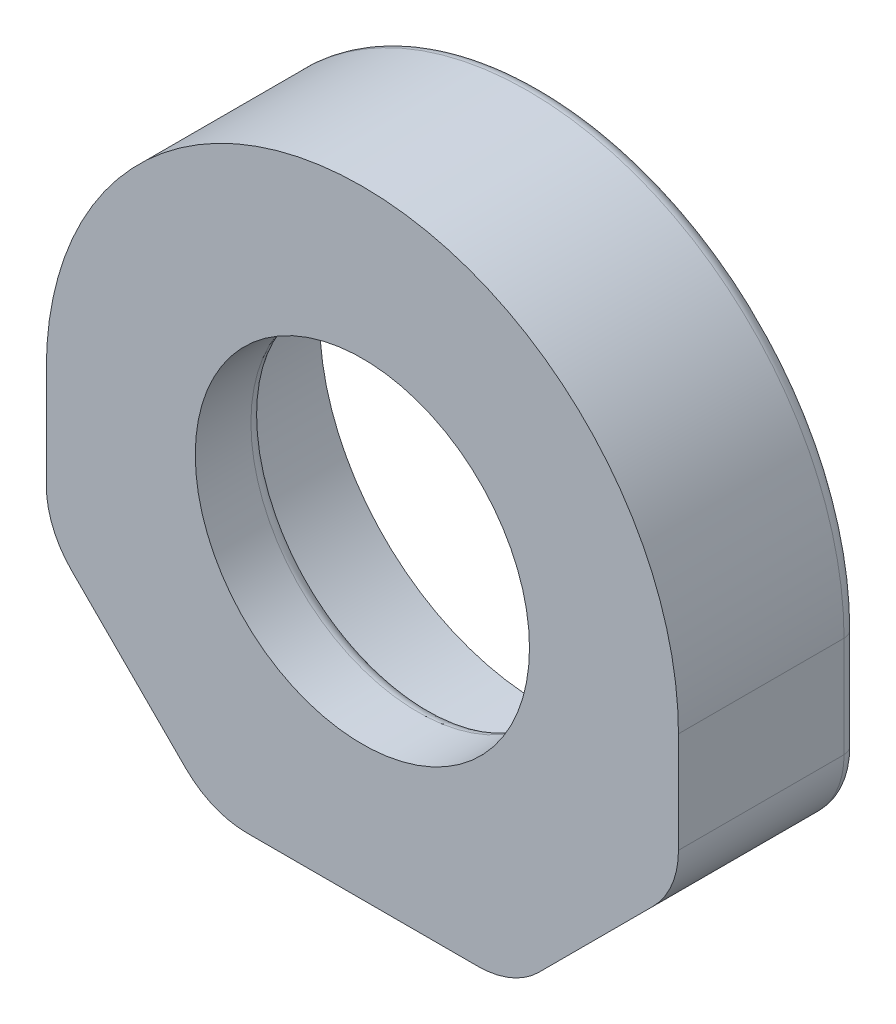
ISO-10303-21;
HEADER;
FILE_DESCRIPTION(('STEP AP214'),'2;1');
FILE_NAME('part.step','',(''),(''),'','','');
FILE_SCHEMA(('AUTOMOTIVE_DESIGN { 1 0 10303 214 1 1 1 1 }'));
ENDSEC;
DATA;
#1=APPLICATION_CONTEXT('core data for automotive mechanical design processes');
#2=APPLICATION_PROTOCOL_DEFINITION('international standard','automotive_design',2000,#1);
#3=PRODUCT_CONTEXT('',#1,'mechanical');
#4=PRODUCT('Part','Part','',(#3));
#5=PRODUCT_RELATED_PRODUCT_CATEGORY('part','',(#4));
#6=PRODUCT_DEFINITION_FORMATION('','',#4);
#7=PRODUCT_DEFINITION_CONTEXT('part definition',#1,'design');
#8=PRODUCT_DEFINITION('design','',#6,#7);
#9=PRODUCT_DEFINITION_SHAPE('','',#8);
#10=(LENGTH_UNIT() NAMED_UNIT(*) SI_UNIT(.MILLI.,.METRE.));
#11=(NAMED_UNIT(*) PLANE_ANGLE_UNIT() SI_UNIT($,.RADIAN.));
#12=(NAMED_UNIT(*) SI_UNIT($,.STERADIAN.) SOLID_ANGLE_UNIT());
#13=UNCERTAINTY_MEASURE_WITH_UNIT(LENGTH_MEASURE(1.E-05),#10,'distance_accuracy_value','');
#14=(GEOMETRIC_REPRESENTATION_CONTEXT(3) GLOBAL_UNCERTAINTY_ASSIGNED_CONTEXT((#13)) GLOBAL_UNIT_ASSIGNED_CONTEXT((#10,
#11,#12)) REPRESENTATION_CONTEXT('',''));
#15=CARTESIAN_POINT('',(0.,0.,0.));
#16=DIRECTION('',(0.,0.,1.));
#17=DIRECTION('',(1.,0.,0.));
#18=AXIS2_PLACEMENT_3D('',#15,#16,#17);
#19=CARTESIAN_POINT('',(0.,0.,63.5));
#20=DIRECTION('',(0.,0.,-1.));
#21=DIRECTION('',(-1.,0.,0.));
#22=AXIS2_PLACEMENT_3D('',#19,#20,#21);
#23=CYLINDRICAL_SURFACE('',#22,19.304);
#24=CARTESIAN_POINT('',(0.,0.,-42.7834107348118));
#25=DIRECTION('',(0.,0.,-1.));
#26=DIRECTION('',(-1.,0.,0.));
#27=AXIS2_PLACEMENT_3D('',#24,#25,#26);
#28=CIRCLE('',#27,19.304);
#29=CARTESIAN_POINT('',(-19.304,0.,-42.7834107348118));
#30=VERTEX_POINT('',#29);
#31=EDGE_CURVE('E281',#30,#30,#28,.F.);
#32=ORIENTED_EDGE('',*,*,#31,.T.);
#33=EDGE_LOOP('',(#32));
#34=FACE_BOUND('',#33,.T.);
#35=CARTESIAN_POINT('',(0.,0.,-49.2125));
#36=DIRECTION('',(0.,0.,-1.));
#37=DIRECTION('',(-1.,0.,0.));
#38=AXIS2_PLACEMENT_3D('',#35,#36,#37);
#39=CIRCLE('',#38,19.304);
#40=CARTESIAN_POINT('',(-19.304,0.,-49.2125));
#41=VERTEX_POINT('',#40);
#42=EDGE_CURVE('E271',#41,#41,#39,.T.);
#43=ORIENTED_EDGE('',*,*,#42,.T.);
#44=EDGE_LOOP('',(#43));
#45=FACE_BOUND('',#44,.T.);
#46=ADVANCED_FACE('F42',(#34,#45),#23,.F.);
#47=CARTESIAN_POINT('',(0.,0.,-63.5));
#48=DIRECTION('',(0.,0.,1.));
#49=DIRECTION('',(1.,0.,0.));
#50=AXIS2_PLACEMENT_3D('',#47,#48,#49);
#51=CYLINDRICAL_SURFACE('',#50,36.5125);
#52=CARTESIAN_POINT('',(0.,0.,-42.7834107348118));
#53=DIRECTION('',(0.,0.,-1.));
#54=DIRECTION('',(-1.,0.,0.));
#55=AXIS2_PLACEMENT_3D('',#52,#53,#54);
#56=CIRCLE('',#55,36.5125);
#57=CARTESIAN_POINT('',(36.5125,0.,-42.7834107348118));
#58=VERTEX_POINT('',#57);
#59=CARTESIAN_POINT('',(-36.5125,0.,-42.7834107348118));
#60=VERTEX_POINT('',#59);
#61=EDGE_CURVE('E161',#58,#60,#56,.F.);
#62=ORIENTED_EDGE('',*,*,#61,.F.);
#63=DIRECTION('',(0.,0.,1.));
#64=VECTOR('',#63,1.);
#65=CARTESIAN_POINT('',(36.5125,0.,-63.5));
#66=LINE('',#65,#64);
#67=CARTESIAN_POINT('',(36.5125,0.,-61.9125));
#68=VERTEX_POINT('',#67);
#69=EDGE_CURVE('E169',#68,#58,#66,.T.);
#70=ORIENTED_EDGE('',*,*,#69,.F.);
#71=CARTESIAN_POINT('',(0.,0.,-61.9125));
#72=DIRECTION('',(0.,0.,1.));
#73=DIRECTION('',(1.,0.,0.));
#74=AXIS2_PLACEMENT_3D('',#71,#72,#73);
#75=CIRCLE('',#74,36.5125);
#76=CARTESIAN_POINT('',(-36.5125,0.,-61.9125));
#77=VERTEX_POINT('',#76);
#78=EDGE_CURVE('E51',#68,#77,#75,.T.);
#79=ORIENTED_EDGE('',*,*,#78,.T.);
#80=DIRECTION('',(0.,0.,1.));
#81=VECTOR('',#80,1.);
#82=CARTESIAN_POINT('',(-36.5125,0.,-63.5));
#83=LINE('',#82,#81);
#84=EDGE_CURVE('E178',#77,#60,#83,.T.);
#85=ORIENTED_EDGE('',*,*,#84,.T.);
#86=EDGE_LOOP('',(#62,#70,#79,#85));
#87=FACE_BOUND('',#86,.T.);
#88=ADVANCED_FACE('F354',(#87),#51,.T.);
#89=CARTESIAN_POINT('',(36.5125,0.,-63.5));
#90=DIRECTION('',(-1.,0.,0.));
#91=DIRECTION('',(0.,0.,1.));
#92=AXIS2_PLACEMENT_3D('',#89,#90,#91);
#93=PLANE('',#92);
#94=ORIENTED_EDGE('',*,*,#69,.T.);
#95=DIRECTION('',(0.,1.,0.));
#96=VECTOR('',#95,1.);
#97=CARTESIAN_POINT('',(36.5125,-34.8451023838905,-42.7834107348118));
#98=LINE('',#97,#96);
#99=CARTESIAN_POINT('',(36.5125,-11.6529667601595,-42.7834107348118));
#100=VERTEX_POINT('',#99);
#101=EDGE_CURVE('E152',#100,#58,#98,.T.);
#102=ORIENTED_EDGE('',*,*,#101,.F.);
#103=DIRECTION('',(0.,0.,-1.));
#104=VECTOR('',#103,1.);
#105=CARTESIAN_POINT('',(36.5125,-11.6529667601595,-63.5));
#106=LINE('',#105,#104);
#107=CARTESIAN_POINT('',(36.5125,-11.6529667601595,-61.9125));
#108=VERTEX_POINT('',#107);
#109=EDGE_CURVE('E167',#100,#108,#106,.T.);
#110=ORIENTED_EDGE('',*,*,#109,.T.);
#111=DIRECTION('',(0.,-1.,0.));
#112=VECTOR('',#111,1.);
#113=CARTESIAN_POINT('',(36.5125,0.,-61.9125));
#114=LINE('',#113,#112);
#115=EDGE_CURVE('E238',#108,#68,#114,.F.);
#116=ORIENTED_EDGE('',*,*,#115,.T.);
#117=EDGE_LOOP('',(#94,#102,#110,#116));
#118=FACE_BOUND('',#117,.T.);
#119=ADVANCED_FACE('F165',(#118),#93,.F.);
#120=CARTESIAN_POINT('',(-36.5125,-34.8451023838905,-63.5));
#121=DIRECTION('',(0.,-1.,0.));
#122=DIRECTION('',(0.,0.,-1.));
#123=AXIS2_PLACEMENT_3D('',#120,#121,#122);
#124=PLANE('',#123);
#125=DIRECTION('',(1.,0.,0.));
#126=VECTOR('',#125,1.);
#127=CARTESIAN_POINT('',(-36.5125,-34.8451023838905,-42.7834107348118));
#128=LINE('',#127,#126);
#129=CARTESIAN_POINT('',(-13.320364376269,-34.8451023838905,-42.7834107348118));
#130=VERTEX_POINT('',#129);
#131=CARTESIAN_POINT('',(13.320364376269,-34.8451023838905,-42.7834107348118));
#132=VERTEX_POINT('',#131);
#133=EDGE_CURVE('E346',#130,#132,#128,.T.);
#134=ORIENTED_EDGE('',*,*,#133,.F.);
#135=DIRECTION('',(0.,0.,1.));
#136=VECTOR('',#135,1.);
#137=CARTESIAN_POINT('',(-13.320364376269,-34.8451023838905,-63.5));
#138=LINE('',#137,#136);
#139=CARTESIAN_POINT('',(-13.320364376269,-34.8451023838905,-61.9125));
#140=VERTEX_POINT('',#139);
#141=EDGE_CURVE('E189',#130,#140,#138,.F.);
#142=ORIENTED_EDGE('',*,*,#141,.T.);
#143=DIRECTION('',(1.,0.,0.));
#144=VECTOR('',#143,1.);
#145=CARTESIAN_POINT('',(13.320364376269,-34.8451023838905,-61.9125));
#146=LINE('',#145,#144);
#147=CARTESIAN_POINT('',(13.320364376269,-34.8451023838905,-61.9125));
#148=VERTEX_POINT('',#147);
#149=EDGE_CURVE('E250',#140,#148,#146,.T.);
#150=ORIENTED_EDGE('',*,*,#149,.T.);
#151=DIRECTION('',(0.,0.,1.));
#152=VECTOR('',#151,1.);
#153=CARTESIAN_POINT('',(13.320364376269,-34.8451023838905,-63.5));
#154=LINE('',#153,#152);
#155=EDGE_CURVE('E192',#148,#132,#154,.T.);
#156=ORIENTED_EDGE('',*,*,#155,.T.);
#157=EDGE_LOOP('',(#134,#142,#150,#156));
#158=FACE_BOUND('',#157,.T.);
#159=ADVANCED_FACE('F361',(#158),#124,.T.);
#160=CARTESIAN_POINT('',(-36.5125,0.,-63.5));
#161=DIRECTION('',(-1.,0.,0.));
#162=DIRECTION('',(0.,0.,1.));
#163=AXIS2_PLACEMENT_3D('',#160,#161,#162);
#164=PLANE('',#163);
#165=DIRECTION('',(0.,1.,0.));
#166=VECTOR('',#165,1.);
#167=CARTESIAN_POINT('',(-36.5125,-34.8451023838905,-42.7834107348118));
#168=LINE('',#167,#166);
#169=CARTESIAN_POINT('',(-36.5125,-11.6529667601595,-42.7834107348118));
#170=VERTEX_POINT('',#169);
#171=EDGE_CURVE('E57',#170,#60,#168,.T.);
#172=ORIENTED_EDGE('',*,*,#171,.T.);
#173=ORIENTED_EDGE('',*,*,#84,.F.);
#174=DIRECTION('',(0.,-1.,0.));
#175=VECTOR('',#174,1.);
#176=CARTESIAN_POINT('',(-36.5125,-11.6529667601595,-61.9125));
#177=LINE('',#176,#175);
#178=CARTESIAN_POINT('',(-36.5125,-11.6529667601595,-61.9125));
#179=VERTEX_POINT('',#178);
#180=EDGE_CURVE('E264',#77,#179,#177,.T.);
#181=ORIENTED_EDGE('',*,*,#180,.T.);
#182=DIRECTION('',(0.,0.,-1.));
#183=VECTOR('',#182,1.);
#184=CARTESIAN_POINT('',(-36.5125,-11.6529667601595,-63.5));
#185=LINE('',#184,#183);
#186=EDGE_CURVE('E203',#179,#170,#185,.F.);
#187=ORIENTED_EDGE('',*,*,#186,.T.);
#188=EDGE_LOOP('',(#172,#173,#181,#187));
#189=FACE_BOUND('',#188,.T.);
#190=ADVANCED_FACE('F351',(#189),#164,.T.);
#191=CARTESIAN_POINT('',(0.,0.,-63.5));
#192=DIRECTION('',(0.,0.,1.));
#193=DIRECTION('',(1.,0.,0.));
#194=AXIS2_PLACEMENT_3D('',#191,#192,#193);
#195=PLANE('',#194);
#196=CARTESIAN_POINT('',(0.,0.,-63.5));
#197=DIRECTION('',(0.,0.,1.));
#198=DIRECTION('',(1.,0.,0.));
#199=AXIS2_PLACEMENT_3D('',#196,#197,#198);
#200=CIRCLE('',#199,34.925);
#201=CARTESIAN_POINT('',(-34.925,0.,-63.5));
#202=VERTEX_POINT('',#201);
#203=CARTESIAN_POINT('',(34.925,0.,-63.5));
#204=VERTEX_POINT('',#203);
#205=EDGE_CURVE('E207',#202,#204,#200,.F.);
#206=ORIENTED_EDGE('',*,*,#205,.T.);
#207=DIRECTION('',(0.,-1.,0.));
#208=VECTOR('',#207,1.);
#209=CARTESIAN_POINT('',(34.925,0.,-63.5));
#210=LINE('',#209,#208);
#211=CARTESIAN_POINT('',(34.925,-11.6529667601595,-63.5));
#212=VERTEX_POINT('',#211);
#213=EDGE_CURVE('E234',#204,#212,#210,.T.);
#214=ORIENTED_EDGE('',*,*,#213,.T.);
#215=CARTESIAN_POINT('',(26.5125,-11.6529667601595,-63.5));
#216=DIRECTION('',(0.,0.,1.));
#217=DIRECTION('',(1.,0.,0.));
#218=AXIS2_PLACEMENT_3D('',#215,#216,#217);
#219=CIRCLE('',#218,8.4125);
#220=CARTESIAN_POINT('',(32.4610357967318,-17.6015025568913,-63.5));
#221=VERTEX_POINT('',#220);
#222=EDGE_CURVE('E231',#212,#221,#219,.F.);
#223=ORIENTED_EDGE('',*,*,#222,.T.);
#224=DIRECTION('',(-0.707106781186546,-0.707106781186549,0.));
#225=VECTOR('',#224,1.);
#226=CARTESIAN_POINT('',(19.2689001730009,-30.7936381806223,-63.5));
#227=LINE('',#226,#225);
#228=CARTESIAN_POINT('',(19.2689001730009,-30.7936381806223,-63.5));
#229=VERTEX_POINT('',#228);
#230=EDGE_CURVE('E228',#221,#229,#227,.T.);
#231=ORIENTED_EDGE('',*,*,#230,.T.);
#232=CARTESIAN_POINT('',(13.320364376269,-24.8451023838905,-63.5));
#233=DIRECTION('',(0.,0.,1.));
#234=DIRECTION('',(1.,0.,0.));
#235=AXIS2_PLACEMENT_3D('',#232,#233,#234);
#236=CIRCLE('',#235,8.4125);
#237=CARTESIAN_POINT('',(13.320364376269,-33.2576023838905,-63.5));
#238=VERTEX_POINT('',#237);
#239=EDGE_CURVE('E225',#229,#238,#236,.F.);
#240=ORIENTED_EDGE('',*,*,#239,.T.);
#241=DIRECTION('',(1.,0.,0.));
#242=VECTOR('',#241,1.);
#243=CARTESIAN_POINT('',(-13.320364376269,-33.2576023838905,-63.5));
#244=LINE('',#243,#242);
#245=CARTESIAN_POINT('',(-13.320364376269,-33.2576023838905,-63.5));
#246=VERTEX_POINT('',#245);
#247=EDGE_CURVE('E222',#238,#246,#244,.F.);
#248=ORIENTED_EDGE('',*,*,#247,.T.);
#249=CARTESIAN_POINT('',(-13.320364376269,-24.8451023838905,-63.5));
#250=DIRECTION('',(0.,0.,1.));
#251=DIRECTION('',(1.,0.,0.));
#252=AXIS2_PLACEMENT_3D('',#249,#250,#251);
#253=CIRCLE('',#252,8.4125);
#254=CARTESIAN_POINT('',(-19.2689001730008,-30.7936381806223,-63.5));
#255=VERTEX_POINT('',#254);
#256=EDGE_CURVE('E219',#246,#255,#253,.F.);
#257=ORIENTED_EDGE('',*,*,#256,.T.);
#258=DIRECTION('',(0.707106781186549,-0.707106781186546,0.));
#259=VECTOR('',#258,1.);
#260=CARTESIAN_POINT('',(-32.4610357967318,-17.6015025568914,-63.5));
#261=LINE('',#260,#259);
#262=CARTESIAN_POINT('',(-32.4610357967318,-17.6015025568914,-63.5));
#263=VERTEX_POINT('',#262);
#264=EDGE_CURVE('E216',#255,#263,#261,.F.);
#265=ORIENTED_EDGE('',*,*,#264,.T.);
#266=CARTESIAN_POINT('',(-26.5125,-11.6529667601595,-63.5));
#267=DIRECTION('',(0.,0.,1.));
#268=DIRECTION('',(1.,0.,0.));
#269=AXIS2_PLACEMENT_3D('',#266,#267,#268);
#270=CIRCLE('',#269,8.4125);
#271=CARTESIAN_POINT('',(-34.925,-11.6529667601595,-63.5));
#272=VERTEX_POINT('',#271);
#273=EDGE_CURVE('E213',#263,#272,#270,.F.);
#274=ORIENTED_EDGE('',*,*,#273,.T.);
#275=DIRECTION('',(0.,-1.,0.));
#276=VECTOR('',#275,1.);
#277=CARTESIAN_POINT('',(-34.925,0.,-63.5));
#278=LINE('',#277,#276);
#279=EDGE_CURVE('E210',#272,#202,#278,.F.);
#280=ORIENTED_EDGE('',*,*,#279,.T.);
#281=EDGE_LOOP('',(#206,#214,#223,#231,#240,#248,#257,#265,#274,#280));
#282=FACE_BOUND('',#281,.T.);
#283=CARTESIAN_POINT('',(0.,0.,-63.5));
#284=DIRECTION('',(0.,0.,-1.));
#285=DIRECTION('',(-1.,0.,0.));
#286=AXIS2_PLACEMENT_3D('',#283,#284,#285);
#287=CIRCLE('',#286,25.654);
#288=CARTESIAN_POINT('',(-25.654,0.,-63.5));
#289=VERTEX_POINT('',#288);
#290=EDGE_CURVE('E314',#289,#289,#287,.T.);
#291=ORIENTED_EDGE('',*,*,#290,.F.);
#292=EDGE_LOOP('',(#291));
#293=FACE_BOUND('',#292,.T.);
#294=ADVANCED_FACE('F367',(#282,#293),#195,.F.);
#295=CARTESIAN_POINT('',(0.,0.,-50.8));
#296=DIRECTION('',(0.,0.,-1.));
#297=DIRECTION('',(-1.,0.,0.));
#298=AXIS2_PLACEMENT_3D('',#295,#296,#297);
#299=PLANE('',#298);
#300=CARTESIAN_POINT('',(0.,0.,-50.8));
#301=DIRECTION('',(0.,0.,-1.));
#302=DIRECTION('',(-1.,0.,0.));
#303=AXIS2_PLACEMENT_3D('',#300,#301,#302);
#304=CIRCLE('',#303,20.8915);
#305=CARTESIAN_POINT('',(-20.8915,0.,-50.8));
#306=VERTEX_POINT('',#305);
#307=EDGE_CURVE('E267',#306,#306,#304,.F.);
#308=ORIENTED_EDGE('',*,*,#307,.T.);
#309=EDGE_LOOP('',(#308));
#310=FACE_BOUND('',#309,.T.);
#311=CARTESIAN_POINT('',(0.,0.,-50.8));
#312=DIRECTION('',(0.,0.,-1.));
#313=DIRECTION('',(-1.,0.,0.));
#314=AXIS2_PLACEMENT_3D('',#311,#312,#313);
#315=CIRCLE('',#314,25.654);
#316=CARTESIAN_POINT('',(-25.654,0.,-50.8));
#317=VERTEX_POINT('',#316);
#318=EDGE_CURVE('E321',#317,#317,#315,.T.);
#319=ORIENTED_EDGE('',*,*,#318,.T.);
#320=EDGE_LOOP('',(#319));
#321=FACE_BOUND('',#320,.T.);
#322=ADVANCED_FACE('F470',(#310,#321),#299,.T.);
#323=CARTESIAN_POINT('',(0.,0.,-50.8));
#324=DIRECTION('',(0.,0.,-1.));
#325=DIRECTION('',(-1.,0.,0.));
#326=AXIS2_PLACEMENT_3D('',#323,#324,#325);
#327=CYLINDRICAL_SURFACE('',#326,25.654);
#328=ORIENTED_EDGE('',*,*,#318,.F.);
#329=EDGE_LOOP('',(#328));
#330=FACE_BOUND('',#329,.T.);
#331=ORIENTED_EDGE('',*,*,#290,.T.);
#332=EDGE_LOOP('',(#331));
#333=FACE_BOUND('',#332,.T.);
#334=ADVANCED_FACE('F377',(#330,#333),#327,.F.);
#335=CARTESIAN_POINT('',(17.4625,-34.8451023838905,-63.5));
#336=DIRECTION('',(0.707106781186549,-0.707106781186546,0.));
#337=DIRECTION('',(0.,0.,-1.));
#338=AXIS2_PLACEMENT_3D('',#335,#336,#337);
#339=PLANE('',#338);
#340=DIRECTION('',(0.707106781186546,0.707106781186549,0.));
#341=VECTOR('',#340,1.);
#342=CARTESIAN_POINT('',(17.4625,-34.8451023838905,-42.7834107348118));
#343=LINE('',#342,#341);
#344=CARTESIAN_POINT('',(20.3914321881345,-31.9161701957559,-42.7834107348118));
#345=VERTEX_POINT('',#344);
#346=CARTESIAN_POINT('',(33.5835678118655,-18.7240345720249,-42.7834107348118));
#347=VERTEX_POINT('',#346);
#348=EDGE_CURVE('E155',#345,#347,#343,.T.);
#349=ORIENTED_EDGE('',*,*,#348,.F.);
#350=DIRECTION('',(0.,0.,1.));
#351=VECTOR('',#350,1.);
#352=CARTESIAN_POINT('',(20.3914321881345,-31.9161701957559,-63.5));
#353=LINE('',#352,#351);
#354=CARTESIAN_POINT('',(20.3914321881345,-31.9161701957559,-61.9125));
#355=VERTEX_POINT('',#354);
#356=EDGE_CURVE('E177',#345,#355,#353,.F.);
#357=ORIENTED_EDGE('',*,*,#356,.T.);
#358=DIRECTION('',(-0.707106781186546,-0.707106781186549,0.));
#359=VECTOR('',#358,1.);
#360=CARTESIAN_POINT('',(33.5835678118655,-18.7240345720249,-61.9125));
#361=LINE('',#360,#359);
#362=CARTESIAN_POINT('',(33.5835678118655,-18.7240345720249,-61.9125));
#363=VERTEX_POINT('',#362);
#364=EDGE_CURVE('E243',#355,#363,#361,.F.);
#365=ORIENTED_EDGE('',*,*,#364,.T.);
#366=DIRECTION('',(0.,0.,-1.));
#367=VECTOR('',#366,1.);
#368=CARTESIAN_POINT('',(33.5835678118655,-18.7240345720249,63.5));
#369=LINE('',#368,#367);
#370=EDGE_CURVE('E182',#363,#347,#369,.F.);
#371=ORIENTED_EDGE('',*,*,#370,.T.);
#372=EDGE_LOOP('',(#349,#357,#365,#371));
#373=FACE_BOUND('',#372,.T.);
#374=ADVANCED_FACE('F373',(#373),#339,.T.);
#375=CARTESIAN_POINT('',(-36.5125,-15.7951023838905,-63.5));
#376=DIRECTION('',(0.707106781186546,0.707106781186549,0.));
#377=DIRECTION('',(0.,0.,1.));
#378=AXIS2_PLACEMENT_3D('',#375,#376,#377);
#379=PLANE('',#378);
#380=DIRECTION('',(-0.707106781186549,0.707106781186546,0.));
#381=VECTOR('',#380,1.);
#382=CARTESIAN_POINT('',(-36.5125,-15.7951023838905,-42.7834107348118));
#383=LINE('',#382,#381);
#384=CARTESIAN_POINT('',(-33.5835678118655,-18.724034572025,-42.7834107348118));
#385=VERTEX_POINT('',#384);
#386=CARTESIAN_POINT('',(-20.3914321881345,-31.916170195756,-42.7834107348118));
#387=VERTEX_POINT('',#386);
#388=EDGE_CURVE('E343',#385,#387,#383,.F.);
#389=ORIENTED_EDGE('',*,*,#388,.F.);
#390=DIRECTION('',(0.,0.,1.));
#391=VECTOR('',#390,1.);
#392=CARTESIAN_POINT('',(-33.5835678118655,-18.724034572025,-63.5));
#393=LINE('',#392,#391);
#394=CARTESIAN_POINT('',(-33.5835678118655,-18.724034572025,-61.9125));
#395=VERTEX_POINT('',#394);
#396=EDGE_CURVE('E196',#385,#395,#393,.F.);
#397=ORIENTED_EDGE('',*,*,#396,.T.);
#398=DIRECTION('',(-0.707106781186549,0.707106781186546,0.));
#399=VECTOR('',#398,1.);
#400=CARTESIAN_POINT('',(-20.3914321881345,-31.916170195756,-61.9125));
#401=LINE('',#400,#399);
#402=CARTESIAN_POINT('',(-20.3914321881345,-31.916170195756,-61.9125));
#403=VERTEX_POINT('',#402);
#404=EDGE_CURVE('E257',#395,#403,#401,.F.);
#405=ORIENTED_EDGE('',*,*,#404,.T.);
#406=DIRECTION('',(0.,0.,-1.));
#407=VECTOR('',#406,1.);
#408=CARTESIAN_POINT('',(-20.3914321881345,-31.916170195756,-63.5));
#409=LINE('',#408,#407);
#410=EDGE_CURVE('E199',#403,#387,#409,.F.);
#411=ORIENTED_EDGE('',*,*,#410,.T.);
#412=EDGE_LOOP('',(#389,#397,#405,#411));
#413=FACE_BOUND('',#412,.T.);
#414=ADVANCED_FACE('F376',(#413),#379,.F.);
#415=CARTESIAN_POINT('',(26.5125,-11.6529667601595,-63.5));
#416=DIRECTION('',(0.,0.,1.));
#417=DIRECTION('',(1.,0.,0.));
#418=AXIS2_PLACEMENT_3D('',#415,#416,#417);
#419=CYLINDRICAL_SURFACE('',#418,10.);
#420=CARTESIAN_POINT('',(26.5125,-11.6529667601595,-42.7834107348118));
#421=DIRECTION('',(0.,0.,-1.));
#422=DIRECTION('',(-1.,0.,0.));
#423=AXIS2_PLACEMENT_3D('',#420,#421,#422);
#424=CIRCLE('',#423,10.);
#425=EDGE_CURVE('E148',#347,#100,#424,.F.);
#426=ORIENTED_EDGE('',*,*,#425,.F.);
#427=ORIENTED_EDGE('',*,*,#370,.F.);
#428=CARTESIAN_POINT('',(26.5125,-11.6529667601595,-61.9125));
#429=DIRECTION('',(0.,0.,1.));
#430=DIRECTION('',(1.,0.,0.));
#431=AXIS2_PLACEMENT_3D('',#428,#429,#430);
#432=CIRCLE('',#431,10.);
#433=EDGE_CURVE('E174',#363,#108,#432,.T.);
#434=ORIENTED_EDGE('',*,*,#433,.T.);
#435=ORIENTED_EDGE('',*,*,#109,.F.);
#436=EDGE_LOOP('',(#426,#427,#434,#435));
#437=FACE_BOUND('',#436,.T.);
#438=ADVANCED_FACE('F172',(#437),#419,.T.);
#439=CARTESIAN_POINT('',(13.320364376269,-24.8451023838905,-63.5));
#440=DIRECTION('',(0.,0.,1.));
#441=DIRECTION('',(1.,0.,0.));
#442=AXIS2_PLACEMENT_3D('',#439,#440,#441);
#443=CYLINDRICAL_SURFACE('',#442,10.);
#444=CARTESIAN_POINT('',(13.320364376269,-24.8451023838905,-42.7834107348118));
#445=DIRECTION('',(0.,0.,-1.));
#446=DIRECTION('',(-1.,0.,0.));
#447=AXIS2_PLACEMENT_3D('',#444,#445,#446);
#448=CIRCLE('',#447,10.);
#449=EDGE_CURVE('E337',#132,#345,#448,.F.);
#450=ORIENTED_EDGE('',*,*,#449,.F.);
#451=ORIENTED_EDGE('',*,*,#155,.F.);
#452=CARTESIAN_POINT('',(13.320364376269,-24.8451023838905,-61.9125));
#453=DIRECTION('',(0.,0.,1.));
#454=DIRECTION('',(1.,0.,0.));
#455=AXIS2_PLACEMENT_3D('',#452,#453,#454);
#456=CIRCLE('',#455,10.);
#457=EDGE_CURVE('E246',#148,#355,#456,.T.);
#458=ORIENTED_EDGE('',*,*,#457,.T.);
#459=ORIENTED_EDGE('',*,*,#356,.F.);
#460=EDGE_LOOP('',(#450,#451,#458,#459));
#461=FACE_BOUND('',#460,.T.);
#462=ADVANCED_FACE('F384',(#461),#443,.T.);
#463=CARTESIAN_POINT('',(-13.320364376269,-24.8451023838905,-63.5));
#464=DIRECTION('',(0.,0.,1.));
#465=DIRECTION('',(1.,0.,0.));
#466=AXIS2_PLACEMENT_3D('',#463,#464,#465);
#467=CYLINDRICAL_SURFACE('',#466,10.);
#468=CARTESIAN_POINT('',(-13.320364376269,-24.8451023838905,-42.7834107348118));
#469=DIRECTION('',(0.,0.,-1.));
#470=DIRECTION('',(-1.,0.,0.));
#471=AXIS2_PLACEMENT_3D('',#468,#469,#470);
#472=CIRCLE('',#471,10.);
#473=EDGE_CURVE('E340',#387,#130,#472,.F.);
#474=ORIENTED_EDGE('',*,*,#473,.F.);
#475=ORIENTED_EDGE('',*,*,#410,.F.);
#476=CARTESIAN_POINT('',(-13.320364376269,-24.8451023838905,-61.9125));
#477=DIRECTION('',(0.,0.,1.));
#478=DIRECTION('',(1.,0.,0.));
#479=AXIS2_PLACEMENT_3D('',#476,#477,#478);
#480=CIRCLE('',#479,10.);
#481=EDGE_CURVE('E253',#403,#140,#480,.T.);
#482=ORIENTED_EDGE('',*,*,#481,.T.);
#483=ORIENTED_EDGE('',*,*,#141,.F.);
#484=EDGE_LOOP('',(#474,#475,#482,#483));
#485=FACE_BOUND('',#484,.T.);
#486=ADVANCED_FACE('F387',(#485),#467,.T.);
#487=CARTESIAN_POINT('',(-26.5125,-11.6529667601595,-63.5));
#488=DIRECTION('',(0.,0.,-1.));
#489=DIRECTION('',(-1.,0.,0.));
#490=AXIS2_PLACEMENT_3D('',#487,#488,#489);
#491=CYLINDRICAL_SURFACE('',#490,10.);
#492=CARTESIAN_POINT('',(-26.5125,-11.6529667601595,-42.7834107348118));
#493=DIRECTION('',(0.,0.,-1.));
#494=DIRECTION('',(-1.,0.,0.));
#495=AXIS2_PLACEMENT_3D('',#492,#493,#494);
#496=CIRCLE('',#495,10.);
#497=EDGE_CURVE('E11',#170,#385,#496,.F.);
#498=ORIENTED_EDGE('',*,*,#497,.F.);
#499=ORIENTED_EDGE('',*,*,#186,.F.);
#500=CARTESIAN_POINT('',(-26.5125,-11.6529667601595,-61.9125));
#501=DIRECTION('',(0.,0.,1.));
#502=DIRECTION('',(1.,0.,0.));
#503=AXIS2_PLACEMENT_3D('',#500,#501,#502);
#504=CIRCLE('',#503,10.);
#505=EDGE_CURVE('E260',#179,#395,#504,.T.);
#506=ORIENTED_EDGE('',*,*,#505,.T.);
#507=ORIENTED_EDGE('',*,*,#396,.F.);
#508=EDGE_LOOP('',(#498,#499,#506,#507));
#509=FACE_BOUND('',#508,.T.);
#510=ADVANCED_FACE('F391',(#509),#491,.T.);
#511=CARTESIAN_POINT('',(-13.320364376269,-24.8451023838905,-61.9125));
#512=DIRECTION('',(0.,0.,1.));
#513=DIRECTION('',(1.,0.,0.));
#514=AXIS2_PLACEMENT_3D('',#511,#512,#513);
#515=TOROIDAL_SURFACE('',#514,8.4125,1.5875);
#516=CARTESIAN_POINT('',(-13.320364376269,-33.2576023838905,-61.9125));
#517=DIRECTION('',(1.,0.,0.));
#518=DIRECTION('',(0.,0.,-1.));
#519=AXIS2_PLACEMENT_3D('',#516,#517,#518);
#520=CIRCLE('',#519,1.5875);
#521=EDGE_CURVE('E308',#140,#246,#520,.T.);
#522=ORIENTED_EDGE('',*,*,#521,.F.);
#523=ORIENTED_EDGE('',*,*,#481,.F.);
#524=CARTESIAN_POINT('',(-19.2689001730008,-30.7936381806223,-61.9125));
#525=DIRECTION('',(-0.707106781186549,0.707106781186546,0.));
#526=DIRECTION('',(-0.707106781186546,-0.707106781186549,0.));
#527=AXIS2_PLACEMENT_3D('',#524,#525,#526);
#528=CIRCLE('',#527,1.5875);
#529=EDGE_CURVE('E311',#255,#403,#528,.T.);
#530=ORIENTED_EDGE('',*,*,#529,.F.);
#531=ORIENTED_EDGE('',*,*,#256,.F.);
#532=EDGE_LOOP('',(#522,#523,#530,#531));
#533=FACE_BOUND('',#532,.T.);
#534=ADVANCED_FACE('F395',(#533),#515,.T.);
#535=CARTESIAN_POINT('',(-25.0312691768115,-25.0312691768116,-61.9125));
#536=DIRECTION('',(-0.707106781186549,0.707106781186546,0.));
#537=DIRECTION('',(-0.707106781186546,-0.707106781186549,0.));
#538=AXIS2_PLACEMENT_3D('',#535,#536,#537);
#539=CYLINDRICAL_SURFACE('',#538,1.5875);
#540=ORIENTED_EDGE('',*,*,#529,.T.);
#541=ORIENTED_EDGE('',*,*,#404,.F.);
#542=CARTESIAN_POINT('',(-32.4610357967318,-17.6015025568914,-61.9125));
#543=DIRECTION('',(-0.70710678118655,0.707106781186545,0.));
#544=DIRECTION('',(-0.707106781186545,-0.70710678118655,0.));
#545=AXIS2_PLACEMENT_3D('',#542,#543,#544);
#546=CIRCLE('',#545,1.5875);
#547=EDGE_CURVE('E304',#263,#395,#546,.T.);
#548=ORIENTED_EDGE('',*,*,#547,.F.);
#549=ORIENTED_EDGE('',*,*,#264,.F.);
#550=EDGE_LOOP('',(#540,#541,#548,#549));
#551=FACE_BOUND('',#550,.T.);
#552=ADVANCED_FACE('F428',(#551),#539,.T.);
#553=CARTESIAN_POINT('',(-36.5125,-33.2576023838905,-61.9125));
#554=DIRECTION('',(-1.,0.,0.));
#555=DIRECTION('',(0.,0.,1.));
#556=AXIS2_PLACEMENT_3D('',#553,#554,#555);
#557=CYLINDRICAL_SURFACE('',#556,1.5875);
#558=ORIENTED_EDGE('',*,*,#521,.T.);
#559=ORIENTED_EDGE('',*,*,#247,.F.);
#560=CARTESIAN_POINT('',(13.320364376269,-33.2576023838905,-61.9125));
#561=DIRECTION('',(1.,0.,0.));
#562=DIRECTION('',(0.,0.,-1.));
#563=AXIS2_PLACEMENT_3D('',#560,#561,#562);
#564=CIRCLE('',#563,1.5875);
#565=EDGE_CURVE('E300',#148,#238,#564,.T.);
#566=ORIENTED_EDGE('',*,*,#565,.F.);
#567=ORIENTED_EDGE('',*,*,#149,.F.);
#568=EDGE_LOOP('',(#558,#559,#566,#567));
#569=FACE_BOUND('',#568,.T.);
#570=ADVANCED_FACE('F424',(#569),#557,.T.);
#571=CARTESIAN_POINT('',(-26.5125,-11.6529667601595,-61.9125));
#572=DIRECTION('',(0.,0.,1.));
#573=DIRECTION('',(1.,0.,0.));
#574=AXIS2_PLACEMENT_3D('',#571,#572,#573);
#575=TOROIDAL_SURFACE('',#574,8.4125,1.5875);
#576=ORIENTED_EDGE('',*,*,#547,.T.);
#577=ORIENTED_EDGE('',*,*,#505,.F.);
#578=CARTESIAN_POINT('',(-34.925,-11.6529667601595,-61.9125));
#579=DIRECTION('',(0.,1.,0.));
#580=DIRECTION('',(0.,0.,1.));
#581=AXIS2_PLACEMENT_3D('',#578,#579,#580);
#582=CIRCLE('',#581,1.5875);
#583=EDGE_CURVE('E296',#272,#179,#582,.T.);
#584=ORIENTED_EDGE('',*,*,#583,.F.);
#585=ORIENTED_EDGE('',*,*,#273,.F.);
#586=EDGE_LOOP('',(#576,#577,#584,#585));
#587=FACE_BOUND('',#586,.T.);
#588=ADVANCED_FACE('F420',(#587),#575,.T.);
#589=CARTESIAN_POINT('',(13.320364376269,-24.8451023838905,-61.9125));
#590=DIRECTION('',(0.,0.,1.));
#591=DIRECTION('',(1.,0.,0.));
#592=AXIS2_PLACEMENT_3D('',#589,#590,#591);
#593=TOROIDAL_SURFACE('',#592,8.4125,1.5875);
#594=ORIENTED_EDGE('',*,*,#565,.T.);
#595=ORIENTED_EDGE('',*,*,#239,.F.);
#596=CARTESIAN_POINT('',(19.2689001730009,-30.7936381806223,-61.9125));
#597=DIRECTION('',(0.707106781186546,0.707106781186549,0.));
#598=DIRECTION('',(-0.707106781186549,0.707106781186546,0.));
#599=AXIS2_PLACEMENT_3D('',#596,#597,#598);
#600=CIRCLE('',#599,1.5875);
#601=EDGE_CURVE('E292',#355,#229,#600,.T.);
#602=ORIENTED_EDGE('',*,*,#601,.F.);
#603=ORIENTED_EDGE('',*,*,#457,.F.);
#604=EDGE_LOOP('',(#594,#595,#602,#603));
#605=FACE_BOUND('',#604,.T.);
#606=ADVANCED_FACE('F416',(#605),#593,.T.);
#607=CARTESIAN_POINT('',(-34.925,0.,-61.9125));
#608=DIRECTION('',(0.,1.,0.));
#609=DIRECTION('',(0.,0.,1.));
#610=AXIS2_PLACEMENT_3D('',#607,#608,#609);
#611=CYLINDRICAL_SURFACE('',#610,1.5875);
#612=ORIENTED_EDGE('',*,*,#583,.T.);
#613=ORIENTED_EDGE('',*,*,#180,.F.);
#614=CARTESIAN_POINT('',(-34.925,0.,-61.9125));
#615=DIRECTION('',(0.,1.,0.));
#616=DIRECTION('',(0.,0.,1.));
#617=AXIS2_PLACEMENT_3D('',#614,#615,#616);
#618=CIRCLE('',#617,1.5875);
#619=EDGE_CURVE('E288',#202,#77,#618,.T.);
#620=ORIENTED_EDGE('',*,*,#619,.F.);
#621=ORIENTED_EDGE('',*,*,#279,.F.);
#622=EDGE_LOOP('',(#612,#613,#620,#621));
#623=FACE_BOUND('',#622,.T.);
#624=ADVANCED_FACE('F412',(#623),#611,.T.);
#625=CARTESIAN_POINT('',(25.0312691768116,-25.0312691768115,-61.9125));
#626=DIRECTION('',(0.707106781186546,0.707106781186549,0.));
#627=DIRECTION('',(-0.707106781186549,0.707106781186546,0.));
#628=AXIS2_PLACEMENT_3D('',#625,#626,#627);
#629=CYLINDRICAL_SURFACE('',#628,1.5875);
#630=ORIENTED_EDGE('',*,*,#601,.T.);
#631=ORIENTED_EDGE('',*,*,#230,.F.);
#632=CARTESIAN_POINT('',(32.4610357967318,-17.6015025568913,-61.9125));
#633=DIRECTION('',(0.707106781186546,0.707106781186549,0.));
#634=DIRECTION('',(-0.707106781186549,0.707106781186546,0.));
#635=AXIS2_PLACEMENT_3D('',#632,#633,#634);
#636=CIRCLE('',#635,1.5875);
#637=EDGE_CURVE('E284',#363,#221,#636,.T.);
#638=ORIENTED_EDGE('',*,*,#637,.F.);
#639=ORIENTED_EDGE('',*,*,#364,.F.);
#640=EDGE_LOOP('',(#630,#631,#638,#639));
#641=FACE_BOUND('',#640,.T.);
#642=ADVANCED_FACE('F408',(#641),#629,.T.);
#643=CARTESIAN_POINT('',(0.,0.,-61.9125));
#644=DIRECTION('',(0.,0.,1.));
#645=DIRECTION('',(1.,0.,0.));
#646=AXIS2_PLACEMENT_3D('',#643,#644,#645);
#647=TOROIDAL_SURFACE('',#646,34.925,1.5875);
#648=ORIENTED_EDGE('',*,*,#619,.T.);
#649=ORIENTED_EDGE('',*,*,#78,.F.);
#650=CARTESIAN_POINT('',(34.925,0.,-61.9125));
#651=DIRECTION('',(0.,-1.,0.));
#652=DIRECTION('',(0.,0.,-1.));
#653=AXIS2_PLACEMENT_3D('',#650,#651,#652);
#654=CIRCLE('',#653,1.5875);
#655=EDGE_CURVE('E280',#204,#68,#654,.T.);
#656=ORIENTED_EDGE('',*,*,#655,.F.);
#657=ORIENTED_EDGE('',*,*,#205,.F.);
#658=EDGE_LOOP('',(#648,#649,#656,#657));
#659=FACE_BOUND('',#658,.T.);
#660=ADVANCED_FACE('F404',(#659),#647,.T.);
#661=CARTESIAN_POINT('',(26.5125,-11.6529667601595,-61.9125));
#662=DIRECTION('',(0.,0.,1.));
#663=DIRECTION('',(1.,0.,0.));
#664=AXIS2_PLACEMENT_3D('',#661,#662,#663);
#665=TOROIDAL_SURFACE('',#664,8.4125,1.5875);
#666=ORIENTED_EDGE('',*,*,#637,.T.);
#667=ORIENTED_EDGE('',*,*,#222,.F.);
#668=CARTESIAN_POINT('',(34.925,-11.6529667601595,-61.9125));
#669=DIRECTION('',(0.,1.,0.));
#670=DIRECTION('',(0.,0.,1.));
#671=AXIS2_PLACEMENT_3D('',#668,#669,#670);
#672=CIRCLE('',#671,1.5875);
#673=EDGE_CURVE('E277',#108,#212,#672,.T.);
#674=ORIENTED_EDGE('',*,*,#673,.F.);
#675=ORIENTED_EDGE('',*,*,#433,.F.);
#676=EDGE_LOOP('',(#666,#667,#674,#675));
#677=FACE_BOUND('',#676,.T.);
#678=ADVANCED_FACE('F400',(#677),#665,.T.);
#679=CARTESIAN_POINT('',(34.925,0.,-61.9125));
#680=DIRECTION('',(0.,-1.,0.));
#681=DIRECTION('',(0.,0.,-1.));
#682=AXIS2_PLACEMENT_3D('',#679,#680,#681);
#683=CYLINDRICAL_SURFACE('',#682,1.5875);
#684=ORIENTED_EDGE('',*,*,#655,.T.);
#685=ORIENTED_EDGE('',*,*,#115,.F.);
#686=ORIENTED_EDGE('',*,*,#673,.T.);
#687=ORIENTED_EDGE('',*,*,#213,.F.);
#688=EDGE_LOOP('',(#684,#685,#686,#687));
#689=FACE_BOUND('',#688,.T.);
#690=ADVANCED_FACE('F397',(#689),#683,.T.);
#691=CARTESIAN_POINT('',(0.,0.,-49.2125));
#692=DIRECTION('',(0.,0.,-1.));
#693=DIRECTION('',(-1.,0.,0.));
#694=AXIS2_PLACEMENT_3D('',#691,#692,#693);
#695=TOROIDAL_SURFACE('',#694,20.8915,1.5875);
#696=ORIENTED_EDGE('',*,*,#42,.F.);
#697=EDGE_LOOP('',(#696));
#698=FACE_BOUND('',#697,.T.);
#699=ORIENTED_EDGE('',*,*,#307,.F.);
#700=EDGE_LOOP('',(#699));
#701=FACE_BOUND('',#700,.T.);
#702=ADVANCED_FACE('F44',(#698,#701),#695,.T.);
#703=CARTESIAN_POINT('',(-36.5125,-34.8451023838905,-42.7834107348118));
#704=DIRECTION('',(0.,0.,-1.));
#705=DIRECTION('',(-1.,0.,0.));
#706=AXIS2_PLACEMENT_3D('',#703,#704,#705);
#707=PLANE('',#706);
#708=ORIENTED_EDGE('',*,*,#61,.T.);
#709=ORIENTED_EDGE('',*,*,#171,.F.);
#710=ORIENTED_EDGE('',*,*,#497,.T.);
#711=ORIENTED_EDGE('',*,*,#388,.T.);
#712=ORIENTED_EDGE('',*,*,#473,.T.);
#713=ORIENTED_EDGE('',*,*,#133,.T.);
#714=ORIENTED_EDGE('',*,*,#449,.T.);
#715=ORIENTED_EDGE('',*,*,#348,.T.);
#716=ORIENTED_EDGE('',*,*,#425,.T.);
#717=ORIENTED_EDGE('',*,*,#101,.T.);
#718=EDGE_LOOP('',(#708,#709,#710,#711,#712,#713,#714,#715,#716,#717));
#719=FACE_BOUND('',#718,.T.);
#720=ORIENTED_EDGE('',*,*,#31,.F.);
#721=EDGE_LOOP('',(#720));
#722=FACE_BOUND('',#721,.T.);
#723=ADVANCED_FACE('F150',(#719,#722),#707,.F.);
#724=CLOSED_SHELL('',(#46,#88,#119,#159,#190,#294,#322,#334,#374,#414,#438,#462,#486,#510,#534,
#552,#570,#588,#606,#624,#642,#660,#678,#690,#702,#723));
#725=MANIFOLD_SOLID_BREP('B2',#724);
#726=ADVANCED_BREP_SHAPE_REPRESENTATION('',(#18,#725),#14);
#727=SHAPE_DEFINITION_REPRESENTATION(#9,#726);
ENDSEC;
END-ISO-10303-21;
